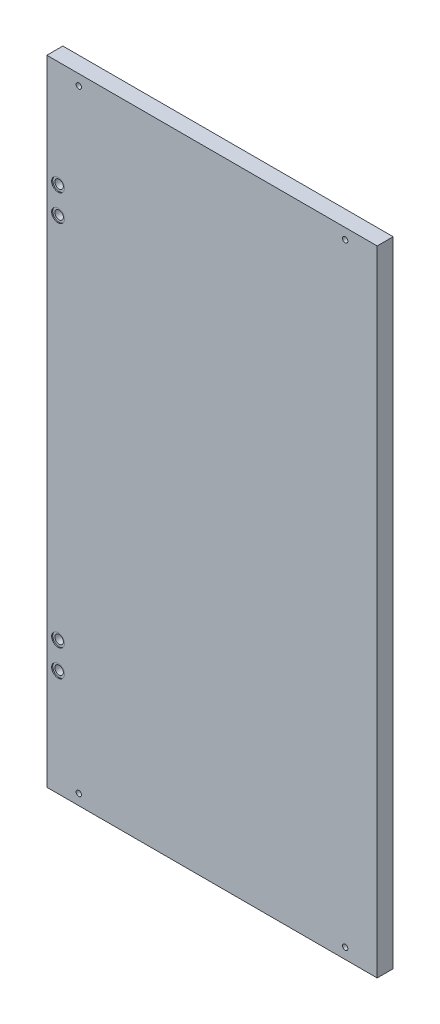
ISO-10303-21;
HEADER;
FILE_DESCRIPTION(('STEP AP214'),'2;1');
FILE_NAME('part.step','',(''),(''),'','','');
FILE_SCHEMA(('AUTOMOTIVE_DESIGN { 1 0 10303 214 1 1 1 1 }'));
ENDSEC;
DATA;
#1=APPLICATION_CONTEXT('core data for automotive mechanical design processes');
#2=APPLICATION_PROTOCOL_DEFINITION('international standard','automotive_design',2000,#1);
#3=PRODUCT_CONTEXT('',#1,'mechanical');
#4=PRODUCT('Part','Part','',(#3));
#5=PRODUCT_RELATED_PRODUCT_CATEGORY('part','',(#4));
#6=PRODUCT_DEFINITION_FORMATION('','',#4);
#7=PRODUCT_DEFINITION_CONTEXT('part definition',#1,'design');
#8=PRODUCT_DEFINITION('design','',#6,#7);
#9=PRODUCT_DEFINITION_SHAPE('','',#8);
#10=(LENGTH_UNIT() NAMED_UNIT(*) SI_UNIT(.MILLI.,.METRE.));
#11=(NAMED_UNIT(*) PLANE_ANGLE_UNIT() SI_UNIT($,.RADIAN.));
#12=(NAMED_UNIT(*) SI_UNIT($,.STERADIAN.) SOLID_ANGLE_UNIT());
#13=UNCERTAINTY_MEASURE_WITH_UNIT(LENGTH_MEASURE(1.E-05),#10,'distance_accuracy_value','');
#14=(GEOMETRIC_REPRESENTATION_CONTEXT(3) GLOBAL_UNCERTAINTY_ASSIGNED_CONTEXT((#13)) GLOBAL_UNIT_ASSIGNED_CONTEXT((#10,
#11,#12)) REPRESENTATION_CONTEXT('',''));
#15=CARTESIAN_POINT('',(0.,0.,0.));
#16=DIRECTION('',(0.,0.,1.));
#17=DIRECTION('',(1.,0.,0.));
#18=AXIS2_PLACEMENT_3D('',#15,#16,#17);
#19=CARTESIAN_POINT('',(-144.5,-172.5,0.));
#20=DIRECTION('',(0.,0.,1.));
#21=DIRECTION('',(1.,0.,0.));
#22=AXIS2_PLACEMENT_3D('',#19,#20,#21);
#23=CYLINDRICAL_SURFACE('',#22,3.99999999999999);
#24=CARTESIAN_POINT('',(-144.5,-172.5,0.));
#25=DIRECTION('',(0.,0.,-1.));
#26=DIRECTION('',(1.,0.,0.));
#27=AXIS2_PLACEMENT_3D('',#24,#25,#26);
#28=CIRCLE('',#27,3.99999999999999);
#29=CARTESIAN_POINT('',(-140.5,-172.5,0.));
#30=VERTEX_POINT('',#29);
#31=EDGE_CURVE('E160',#30,#30,#28,.T.);
#32=ORIENTED_EDGE('',*,*,#31,.T.);
#33=EDGE_LOOP('',(#32));
#34=FACE_BOUND('',#33,.T.);
#35=CARTESIAN_POINT('',(-144.5,-172.5,14.));
#36=DIRECTION('',(0.,0.,1.));
#37=DIRECTION('',(1.,0.,0.));
#38=AXIS2_PLACEMENT_3D('',#35,#36,#37);
#39=CIRCLE('',#38,3.99999999999999);
#40=CARTESIAN_POINT('',(-140.5,-172.5,14.));
#41=VERTEX_POINT('',#40);
#42=EDGE_CURVE('E41',#41,#41,#39,.T.);
#43=ORIENTED_EDGE('',*,*,#42,.T.);
#44=EDGE_LOOP('',(#43));
#45=FACE_BOUND('',#44,.T.);
#46=ADVANCED_FACE('F37',(#34,#45),#23,.F.);
#47=CARTESIAN_POINT('',(-144.5,-197.5,0.));
#48=DIRECTION('',(0.,0.,1.));
#49=DIRECTION('',(1.,0.,0.));
#50=AXIS2_PLACEMENT_3D('',#47,#48,#49);
#51=CYLINDRICAL_SURFACE('',#50,3.99999999999999);
#52=CARTESIAN_POINT('',(-144.5,-197.5,0.));
#53=DIRECTION('',(0.,0.,-1.));
#54=DIRECTION('',(1.,0.,0.));
#55=AXIS2_PLACEMENT_3D('',#52,#53,#54);
#56=CIRCLE('',#55,3.99999999999999);
#57=CARTESIAN_POINT('',(-140.5,-197.5,0.));
#58=VERTEX_POINT('',#57);
#59=EDGE_CURVE('E163',#58,#58,#56,.T.);
#60=ORIENTED_EDGE('',*,*,#59,.T.);
#61=EDGE_LOOP('',(#60));
#62=FACE_BOUND('',#61,.T.);
#63=CARTESIAN_POINT('',(-144.5,-197.5,14.));
#64=DIRECTION('',(0.,0.,1.));
#65=DIRECTION('',(1.,0.,0.));
#66=AXIS2_PLACEMENT_3D('',#63,#64,#65);
#67=CIRCLE('',#66,3.99999999999999);
#68=CARTESIAN_POINT('',(-140.5,-197.5,14.));
#69=VERTEX_POINT('',#68);
#70=EDGE_CURVE('E120',#69,#69,#67,.T.);
#71=ORIENTED_EDGE('',*,*,#70,.T.);
#72=EDGE_LOOP('',(#71));
#73=FACE_BOUND('',#72,.T.);
#74=ADVANCED_FACE('F193',(#62,#73),#51,.F.);
#75=CARTESIAN_POINT('',(-144.5,172.5,0.));
#76=DIRECTION('',(0.,0.,1.));
#77=DIRECTION('',(1.,0.,0.));
#78=AXIS2_PLACEMENT_3D('',#75,#76,#77);
#79=CYLINDRICAL_SURFACE('',#78,3.99999999999999);
#80=CARTESIAN_POINT('',(-144.5,172.5,0.));
#81=DIRECTION('',(0.,0.,1.));
#82=DIRECTION('',(1.,0.,0.));
#83=AXIS2_PLACEMENT_3D('',#80,#81,#82);
#84=CIRCLE('',#83,3.99999999999999);
#85=CARTESIAN_POINT('',(-140.5,172.5,0.));
#86=VERTEX_POINT('',#85);
#87=EDGE_CURVE('E178',#86,#86,#84,.T.);
#88=ORIENTED_EDGE('',*,*,#87,.F.);
#89=EDGE_LOOP('',(#88));
#90=FACE_BOUND('',#89,.T.);
#91=CARTESIAN_POINT('',(-144.5,172.5,14.));
#92=DIRECTION('',(0.,0.,1.));
#93=DIRECTION('',(1.,0.,0.));
#94=AXIS2_PLACEMENT_3D('',#91,#92,#93);
#95=CIRCLE('',#94,3.99999999999999);
#96=CARTESIAN_POINT('',(-140.5,172.5,14.));
#97=VERTEX_POINT('',#96);
#98=EDGE_CURVE('E116',#97,#97,#95,.F.);
#99=ORIENTED_EDGE('',*,*,#98,.F.);
#100=EDGE_LOOP('',(#99));
#101=FACE_BOUND('',#100,.T.);
#102=ADVANCED_FACE('F189',(#90,#101),#79,.F.);
#103=CARTESIAN_POINT('',(-144.5,197.5,0.));
#104=DIRECTION('',(0.,0.,1.));
#105=DIRECTION('',(1.,0.,0.));
#106=AXIS2_PLACEMENT_3D('',#103,#104,#105);
#107=CYLINDRICAL_SURFACE('',#106,3.99999999999999);
#108=CARTESIAN_POINT('',(-144.5,197.5,0.));
#109=DIRECTION('',(0.,0.,1.));
#110=DIRECTION('',(1.,0.,0.));
#111=AXIS2_PLACEMENT_3D('',#108,#109,#110);
#112=CIRCLE('',#111,3.99999999999999);
#113=CARTESIAN_POINT('',(-140.5,197.5,0.));
#114=VERTEX_POINT('',#113);
#115=EDGE_CURVE('E107',#114,#114,#112,.T.);
#116=ORIENTED_EDGE('',*,*,#115,.F.);
#117=EDGE_LOOP('',(#116));
#118=FACE_BOUND('',#117,.T.);
#119=CARTESIAN_POINT('',(-144.5,197.5,14.));
#120=DIRECTION('',(0.,0.,1.));
#121=DIRECTION('',(1.,0.,0.));
#122=AXIS2_PLACEMENT_3D('',#119,#120,#121);
#123=CIRCLE('',#122,3.99999999999999);
#124=CARTESIAN_POINT('',(-140.5,197.5,14.));
#125=VERTEX_POINT('',#124);
#126=EDGE_CURVE('E113',#125,#125,#123,.F.);
#127=ORIENTED_EDGE('',*,*,#126,.F.);
#128=EDGE_LOOP('',(#127));
#129=FACE_BOUND('',#128,.T.);
#130=ADVANCED_FACE('F192',(#118,#129),#107,.F.);
#131=CARTESIAN_POINT('',(155.,297.5,15.));
#132=DIRECTION('',(-1.,0.,0.));
#133=DIRECTION('',(0.,-1.,0.));
#134=AXIS2_PLACEMENT_3D('',#131,#132,#133);
#135=PLANE('',#134);
#136=DIRECTION('',(0.,1.,0.));
#137=VECTOR('',#136,1.);
#138=CARTESIAN_POINT('',(155.,297.5,0.));
#139=LINE('',#138,#137);
#140=CARTESIAN_POINT('',(155.,-297.5,0.));
#141=VERTEX_POINT('',#140);
#142=CARTESIAN_POINT('',(155.,297.5,0.));
#143=VERTEX_POINT('',#142);
#144=EDGE_CURVE('E104',#141,#143,#139,.T.);
#145=ORIENTED_EDGE('',*,*,#144,.T.);
#146=DIRECTION('',(0.,0.,-1.));
#147=VECTOR('',#146,1.);
#148=CARTESIAN_POINT('',(155.,297.5,15.));
#149=LINE('',#148,#147);
#150=CARTESIAN_POINT('',(155.,297.5,15.));
#151=VERTEX_POINT('',#150);
#152=EDGE_CURVE('E11',#151,#143,#149,.T.);
#153=ORIENTED_EDGE('',*,*,#152,.F.);
#154=DIRECTION('',(0.,1.,0.));
#155=VECTOR('',#154,1.);
#156=CARTESIAN_POINT('',(155.,297.5,15.));
#157=LINE('',#156,#155);
#158=CARTESIAN_POINT('',(155.,-297.5,15.));
#159=VERTEX_POINT('',#158);
#160=EDGE_CURVE('E91',#159,#151,#157,.T.);
#161=ORIENTED_EDGE('',*,*,#160,.F.);
#162=DIRECTION('',(0.,0.,-1.));
#163=VECTOR('',#162,1.);
#164=CARTESIAN_POINT('',(155.,-297.5,15.));
#165=LINE('',#164,#163);
#166=EDGE_CURVE('E100',#159,#141,#165,.T.);
#167=ORIENTED_EDGE('',*,*,#166,.T.);
#168=EDGE_LOOP('',(#145,#153,#161,#167));
#169=FACE_BOUND('',#168,.T.);
#170=ADVANCED_FACE('F39',(#169),#135,.F.);
#171=CARTESIAN_POINT('',(-155.,297.5,15.));
#172=DIRECTION('',(0.,-1.,0.));
#173=DIRECTION('',(0.,0.,-1.));
#174=AXIS2_PLACEMENT_3D('',#171,#172,#173);
#175=PLANE('',#174);
#176=DIRECTION('',(-1.,0.,0.));
#177=VECTOR('',#176,1.);
#178=CARTESIAN_POINT('',(-155.,297.5,0.));
#179=LINE('',#178,#177);
#180=CARTESIAN_POINT('',(-155.,297.5,0.));
#181=VERTEX_POINT('',#180);
#182=EDGE_CURVE('E95',#143,#181,#179,.T.);
#183=ORIENTED_EDGE('',*,*,#182,.T.);
#184=DIRECTION('',(0.,0.,-1.));
#185=VECTOR('',#184,1.);
#186=CARTESIAN_POINT('',(-155.,297.5,15.));
#187=LINE('',#186,#185);
#188=CARTESIAN_POINT('',(-155.,297.5,15.));
#189=VERTEX_POINT('',#188);
#190=EDGE_CURVE('E47',#189,#181,#187,.T.);
#191=ORIENTED_EDGE('',*,*,#190,.F.);
#192=DIRECTION('',(-1.,0.,0.));
#193=VECTOR('',#192,1.);
#194=CARTESIAN_POINT('',(-155.,297.5,15.));
#195=LINE('',#194,#193);
#196=EDGE_CURVE('E86',#151,#189,#195,.T.);
#197=ORIENTED_EDGE('',*,*,#196,.F.);
#198=ORIENTED_EDGE('',*,*,#152,.T.);
#199=EDGE_LOOP('',(#183,#191,#197,#198));
#200=FACE_BOUND('',#199,.T.);
#201=ADVANCED_FACE('F94',(#200),#175,.F.);
#202=CARTESIAN_POINT('',(-155.,297.5,15.));
#203=DIRECTION('',(1.,0.,0.));
#204=DIRECTION('',(0.,1.,0.));
#205=AXIS2_PLACEMENT_3D('',#202,#203,#204);
#206=PLANE('',#205);
#207=DIRECTION('',(0.,-1.,0.));
#208=VECTOR('',#207,1.);
#209=CARTESIAN_POINT('',(-155.,297.5,0.));
#210=LINE('',#209,#208);
#211=CARTESIAN_POINT('',(-155.,-297.5,0.));
#212=VERTEX_POINT('',#211);
#213=EDGE_CURVE('E73',#181,#212,#210,.T.);
#214=ORIENTED_EDGE('',*,*,#213,.T.);
#215=DIRECTION('',(0.,0.,-1.));
#216=VECTOR('',#215,1.);
#217=CARTESIAN_POINT('',(-155.,-297.5,15.));
#218=LINE('',#217,#216);
#219=CARTESIAN_POINT('',(-155.,-297.5,15.));
#220=VERTEX_POINT('',#219);
#221=EDGE_CURVE('E96',#220,#212,#218,.T.);
#222=ORIENTED_EDGE('',*,*,#221,.F.);
#223=DIRECTION('',(0.,-1.,0.));
#224=VECTOR('',#223,1.);
#225=CARTESIAN_POINT('',(-155.,297.5,15.));
#226=LINE('',#225,#224);
#227=EDGE_CURVE('E89',#189,#220,#226,.T.);
#228=ORIENTED_EDGE('',*,*,#227,.F.);
#229=ORIENTED_EDGE('',*,*,#190,.T.);
#230=EDGE_LOOP('',(#214,#222,#228,#229));
#231=FACE_BOUND('',#230,.T.);
#232=ADVANCED_FACE('F98',(#231),#206,.F.);
#233=CARTESIAN_POINT('',(-155.,-297.5,15.));
#234=DIRECTION('',(0.,1.,0.));
#235=DIRECTION('',(0.,0.,1.));
#236=AXIS2_PLACEMENT_3D('',#233,#234,#235);
#237=PLANE('',#236);
#238=DIRECTION('',(1.,0.,0.));
#239=VECTOR('',#238,1.);
#240=CARTESIAN_POINT('',(-155.,-297.5,0.));
#241=LINE('',#240,#239);
#242=EDGE_CURVE('E79',#212,#141,#241,.T.);
#243=ORIENTED_EDGE('',*,*,#242,.T.);
#244=ORIENTED_EDGE('',*,*,#166,.F.);
#245=DIRECTION('',(1.,0.,0.));
#246=VECTOR('',#245,1.);
#247=CARTESIAN_POINT('',(-155.,-297.5,15.));
#248=LINE('',#247,#246);
#249=EDGE_CURVE('E56',#220,#159,#248,.T.);
#250=ORIENTED_EDGE('',*,*,#249,.F.);
#251=ORIENTED_EDGE('',*,*,#221,.T.);
#252=EDGE_LOOP('',(#243,#244,#250,#251));
#253=FACE_BOUND('',#252,.T.);
#254=ADVANCED_FACE('F239',(#253),#237,.F.);
#255=CARTESIAN_POINT('',(0.,0.,15.));
#256=DIRECTION('',(0.,0.,1.));
#257=DIRECTION('',(1.,0.,0.));
#258=AXIS2_PLACEMENT_3D('',#255,#256,#257);
#259=PLANE('',#258);
#260=CARTESIAN_POINT('',(-144.5,-197.5,15.));
#261=DIRECTION('',(0.,0.,-1.));
#262=DIRECTION('',(1.,0.,0.));
#263=AXIS2_PLACEMENT_3D('',#260,#261,#262);
#264=CIRCLE('',#263,6.00000000000002);
#265=CARTESIAN_POINT('',(-138.5,-197.5,15.));
#266=VERTEX_POINT('',#265);
#267=EDGE_CURVE('E128',#266,#266,#264,.T.);
#268=ORIENTED_EDGE('',*,*,#267,.T.);
#269=EDGE_LOOP('',(#268));
#270=FACE_BOUND('',#269,.T.);
#271=CARTESIAN_POINT('',(-144.5,-172.5,15.));
#272=DIRECTION('',(0.,0.,-1.));
#273=DIRECTION('',(1.,0.,0.));
#274=AXIS2_PLACEMENT_3D('',#271,#272,#273);
#275=CIRCLE('',#274,6.00000000000002);
#276=CARTESIAN_POINT('',(-138.5,-172.5,15.));
#277=VERTEX_POINT('',#276);
#278=EDGE_CURVE('E138',#277,#277,#275,.T.);
#279=ORIENTED_EDGE('',*,*,#278,.T.);
#280=EDGE_LOOP('',(#279));
#281=FACE_BOUND('',#280,.T.);
#282=CARTESIAN_POINT('',(-144.5,197.5,15.));
#283=DIRECTION('',(0.,0.,1.));
#284=DIRECTION('',(1.,0.,0.));
#285=AXIS2_PLACEMENT_3D('',#282,#283,#284);
#286=CIRCLE('',#285,6.00000000000002);
#287=CARTESIAN_POINT('',(-138.5,197.5,15.));
#288=VERTEX_POINT('',#287);
#289=EDGE_CURVE('E143',#288,#288,#286,.T.);
#290=ORIENTED_EDGE('',*,*,#289,.F.);
#291=EDGE_LOOP('',(#290));
#292=FACE_BOUND('',#291,.T.);
#293=CARTESIAN_POINT('',(-144.5,172.5,15.));
#294=DIRECTION('',(0.,0.,1.));
#295=DIRECTION('',(1.,0.,0.));
#296=AXIS2_PLACEMENT_3D('',#293,#294,#295);
#297=CIRCLE('',#296,6.00000000000002);
#298=CARTESIAN_POINT('',(-138.5,172.5,15.));
#299=VERTEX_POINT('',#298);
#300=EDGE_CURVE('E146',#299,#299,#297,.T.);
#301=ORIENTED_EDGE('',*,*,#300,.F.);
#302=EDGE_LOOP('',(#301));
#303=FACE_BOUND('',#302,.T.);
#304=CARTESIAN_POINT('',(125.,287.5,15.));
#305=DIRECTION('',(0.,0.,-1.));
#306=DIRECTION('',(-1.,0.,0.));
#307=AXIS2_PLACEMENT_3D('',#304,#305,#306);
#308=CIRCLE('',#307,2.5);
#309=CARTESIAN_POINT('',(122.5,287.5,15.));
#310=VERTEX_POINT('',#309);
#311=EDGE_CURVE('E119',#310,#310,#308,.T.);
#312=ORIENTED_EDGE('',*,*,#311,.T.);
#313=EDGE_LOOP('',(#312));
#314=FACE_BOUND('',#313,.T.);
#315=CARTESIAN_POINT('',(125.,-287.5,15.));
#316=DIRECTION('',(0.,0.,1.));
#317=DIRECTION('',(-1.,0.,0.));
#318=AXIS2_PLACEMENT_3D('',#315,#316,#317);
#319=CIRCLE('',#318,2.5);
#320=CARTESIAN_POINT('',(122.5,-287.5,15.));
#321=VERTEX_POINT('',#320);
#322=EDGE_CURVE('E154',#321,#321,#319,.T.);
#323=ORIENTED_EDGE('',*,*,#322,.F.);
#324=EDGE_LOOP('',(#323));
#325=FACE_BOUND('',#324,.T.);
#326=CARTESIAN_POINT('',(-125.,-287.5,15.));
#327=DIRECTION('',(0.,0.,-1.));
#328=DIRECTION('',(1.,0.,0.));
#329=AXIS2_PLACEMENT_3D('',#326,#327,#328);
#330=CIRCLE('',#329,2.5);
#331=CARTESIAN_POINT('',(-122.5,-287.5,15.));
#332=VERTEX_POINT('',#331);
#333=EDGE_CURVE('E166',#332,#332,#330,.T.);
#334=ORIENTED_EDGE('',*,*,#333,.T.);
#335=EDGE_LOOP('',(#334));
#336=FACE_BOUND('',#335,.T.);
#337=CARTESIAN_POINT('',(-125.,287.5,15.));
#338=DIRECTION('',(0.,0.,1.));
#339=DIRECTION('',(1.,0.,0.));
#340=AXIS2_PLACEMENT_3D('',#337,#338,#339);
#341=CIRCLE('',#340,2.5);
#342=CARTESIAN_POINT('',(-122.5,287.5,15.));
#343=VERTEX_POINT('',#342);
#344=EDGE_CURVE('E172',#343,#343,#341,.T.);
#345=ORIENTED_EDGE('',*,*,#344,.F.);
#346=EDGE_LOOP('',(#345));
#347=FACE_BOUND('',#346,.T.);
#348=ORIENTED_EDGE('',*,*,#160,.T.);
#349=ORIENTED_EDGE('',*,*,#196,.T.);
#350=ORIENTED_EDGE('',*,*,#227,.T.);
#351=ORIENTED_EDGE('',*,*,#249,.T.);
#352=EDGE_LOOP('',(#348,#349,#350,#351));
#353=FACE_BOUND('',#352,.T.);
#354=ADVANCED_FACE('F87',(#270,#281,#292,#303,#314,#325,#336,#347,#353),#259,.T.);
#355=CARTESIAN_POINT('',(0.,0.,0.));
#356=DIRECTION('',(0.,0.,1.));
#357=DIRECTION('',(1.,0.,0.));
#358=AXIS2_PLACEMENT_3D('',#355,#356,#357);
#359=PLANE('',#358);
#360=CARTESIAN_POINT('',(125.,287.5,0.));
#361=DIRECTION('',(0.,0.,-1.));
#362=DIRECTION('',(-1.,0.,0.));
#363=AXIS2_PLACEMENT_3D('',#360,#361,#362);
#364=CIRCLE('',#363,2.5);
#365=CARTESIAN_POINT('',(122.5,287.5,0.));
#366=VERTEX_POINT('',#365);
#367=EDGE_CURVE('E151',#366,#366,#364,.T.);
#368=ORIENTED_EDGE('',*,*,#367,.F.);
#369=EDGE_LOOP('',(#368));
#370=FACE_BOUND('',#369,.T.);
#371=CARTESIAN_POINT('',(125.,-287.5,0.));
#372=DIRECTION('',(0.,0.,1.));
#373=DIRECTION('',(-1.,0.,0.));
#374=AXIS2_PLACEMENT_3D('',#371,#372,#373);
#375=CIRCLE('',#374,2.5);
#376=CARTESIAN_POINT('',(122.5,-287.5,0.));
#377=VERTEX_POINT('',#376);
#378=EDGE_CURVE('E157',#377,#377,#375,.T.);
#379=ORIENTED_EDGE('',*,*,#378,.T.);
#380=EDGE_LOOP('',(#379));
#381=FACE_BOUND('',#380,.T.);
#382=ORIENTED_EDGE('',*,*,#59,.F.);
#383=EDGE_LOOP('',(#382));
#384=FACE_BOUND('',#383,.T.);
#385=ORIENTED_EDGE('',*,*,#31,.F.);
#386=EDGE_LOOP('',(#385));
#387=FACE_BOUND('',#386,.T.);
#388=CARTESIAN_POINT('',(-125.,-287.5,0.));
#389=DIRECTION('',(0.,0.,-1.));
#390=DIRECTION('',(1.,0.,0.));
#391=AXIS2_PLACEMENT_3D('',#388,#389,#390);
#392=CIRCLE('',#391,2.5);
#393=CARTESIAN_POINT('',(-122.5,-287.5,0.));
#394=VERTEX_POINT('',#393);
#395=EDGE_CURVE('E169',#394,#394,#392,.T.);
#396=ORIENTED_EDGE('',*,*,#395,.F.);
#397=EDGE_LOOP('',(#396));
#398=FACE_BOUND('',#397,.T.);
#399=CARTESIAN_POINT('',(-125.,287.5,0.));
#400=DIRECTION('',(0.,0.,1.));
#401=DIRECTION('',(1.,0.,0.));
#402=AXIS2_PLACEMENT_3D('',#399,#400,#401);
#403=CIRCLE('',#402,2.5);
#404=CARTESIAN_POINT('',(-122.5,287.5,0.));
#405=VERTEX_POINT('',#404);
#406=EDGE_CURVE('E175',#405,#405,#403,.T.);
#407=ORIENTED_EDGE('',*,*,#406,.T.);
#408=EDGE_LOOP('',(#407));
#409=FACE_BOUND('',#408,.T.);
#410=ORIENTED_EDGE('',*,*,#115,.T.);
#411=EDGE_LOOP('',(#410));
#412=FACE_BOUND('',#411,.T.);
#413=ORIENTED_EDGE('',*,*,#87,.T.);
#414=EDGE_LOOP('',(#413));
#415=FACE_BOUND('',#414,.T.);
#416=ORIENTED_EDGE('',*,*,#144,.F.);
#417=ORIENTED_EDGE('',*,*,#242,.F.);
#418=ORIENTED_EDGE('',*,*,#213,.F.);
#419=ORIENTED_EDGE('',*,*,#182,.F.);
#420=EDGE_LOOP('',(#416,#417,#418,#419));
#421=FACE_BOUND('',#420,.T.);
#422=ADVANCED_FACE('F186',(#370,#381,#384,#387,#398,#409,#412,#415,#421),#359,.F.);
#423=CARTESIAN_POINT('',(-125.,287.5,0.));
#424=DIRECTION('',(0.,0.,1.));
#425=DIRECTION('',(1.,0.,0.));
#426=AXIS2_PLACEMENT_3D('',#423,#424,#425);
#427=CYLINDRICAL_SURFACE('',#426,2.5);
#428=ORIENTED_EDGE('',*,*,#406,.F.);
#429=EDGE_LOOP('',(#428));
#430=FACE_BOUND('',#429,.T.);
#431=ORIENTED_EDGE('',*,*,#344,.T.);
#432=EDGE_LOOP('',(#431));
#433=FACE_BOUND('',#432,.T.);
#434=ADVANCED_FACE('F229',(#430,#433),#427,.F.);
#435=CARTESIAN_POINT('',(-125.,-287.5,0.));
#436=DIRECTION('',(0.,0.,1.));
#437=DIRECTION('',(1.,0.,0.));
#438=AXIS2_PLACEMENT_3D('',#435,#436,#437);
#439=CYLINDRICAL_SURFACE('',#438,2.5);
#440=ORIENTED_EDGE('',*,*,#395,.T.);
#441=EDGE_LOOP('',(#440));
#442=FACE_BOUND('',#441,.T.);
#443=ORIENTED_EDGE('',*,*,#333,.F.);
#444=EDGE_LOOP('',(#443));
#445=FACE_BOUND('',#444,.T.);
#446=ADVANCED_FACE('F225',(#442,#445),#439,.F.);
#447=CARTESIAN_POINT('',(125.,-287.5,0.));
#448=DIRECTION('',(0.,0.,1.));
#449=DIRECTION('',(1.,0.,0.));
#450=AXIS2_PLACEMENT_3D('',#447,#448,#449);
#451=CYLINDRICAL_SURFACE('',#450,2.5);
#452=ORIENTED_EDGE('',*,*,#378,.F.);
#453=EDGE_LOOP('',(#452));
#454=FACE_BOUND('',#453,.T.);
#455=ORIENTED_EDGE('',*,*,#322,.T.);
#456=EDGE_LOOP('',(#455));
#457=FACE_BOUND('',#456,.T.);
#458=ADVANCED_FACE('F228',(#454,#457),#451,.F.);
#459=CARTESIAN_POINT('',(125.,287.5,0.));
#460=DIRECTION('',(0.,0.,1.));
#461=DIRECTION('',(1.,0.,0.));
#462=AXIS2_PLACEMENT_3D('',#459,#460,#461);
#463=CYLINDRICAL_SURFACE('',#462,2.5);
#464=ORIENTED_EDGE('',*,*,#367,.T.);
#465=EDGE_LOOP('',(#464));
#466=FACE_BOUND('',#465,.T.);
#467=ORIENTED_EDGE('',*,*,#311,.F.);
#468=EDGE_LOOP('',(#467));
#469=FACE_BOUND('',#468,.T.);
#470=ADVANCED_FACE('F362',(#466,#469),#463,.F.);
#471=CARTESIAN_POINT('',(-144.5,197.5,14.));
#472=DIRECTION('',(0.,0.,1.));
#473=DIRECTION('',(1.,0.,0.));
#474=AXIS2_PLACEMENT_3D('',#471,#472,#473);
#475=PLANE('',#474);
#476=CARTESIAN_POINT('',(-144.5,197.5,14.));
#477=DIRECTION('',(0.,0.,1.));
#478=DIRECTION('',(1.,0.,0.));
#479=AXIS2_PLACEMENT_3D('',#476,#477,#478);
#480=CIRCLE('',#479,6.00000000000002);
#481=CARTESIAN_POINT('',(-138.5,197.5,14.));
#482=VERTEX_POINT('',#481);
#483=EDGE_CURVE('E117',#482,#482,#480,.T.);
#484=ORIENTED_EDGE('',*,*,#483,.T.);
#485=EDGE_LOOP('',(#484));
#486=FACE_BOUND('',#485,.T.);
#487=ORIENTED_EDGE('',*,*,#126,.T.);
#488=EDGE_LOOP('',(#487));
#489=FACE_BOUND('',#488,.T.);
#490=ADVANCED_FACE('F210',(#486,#489),#475,.T.);
#491=CARTESIAN_POINT('',(-144.5,197.5,14.));
#492=DIRECTION('',(0.,0.,1.));
#493=DIRECTION('',(1.,0.,0.));
#494=AXIS2_PLACEMENT_3D('',#491,#492,#493);
#495=CYLINDRICAL_SURFACE('',#494,6.00000000000002);
#496=ORIENTED_EDGE('',*,*,#483,.F.);
#497=EDGE_LOOP('',(#496));
#498=FACE_BOUND('',#497,.T.);
#499=ORIENTED_EDGE('',*,*,#289,.T.);
#500=EDGE_LOOP('',(#499));
#501=FACE_BOUND('',#500,.T.);
#502=ADVANCED_FACE('F200',(#498,#501),#495,.F.);
#503=CARTESIAN_POINT('',(-144.5,172.5,14.));
#504=DIRECTION('',(0.,0.,1.));
#505=DIRECTION('',(1.,0.,0.));
#506=AXIS2_PLACEMENT_3D('',#503,#504,#505);
#507=PLANE('',#506);
#508=CARTESIAN_POINT('',(-144.5,172.5,14.));
#509=DIRECTION('',(0.,0.,1.));
#510=DIRECTION('',(1.,0.,0.));
#511=AXIS2_PLACEMENT_3D('',#508,#509,#510);
#512=CIRCLE('',#511,6.00000000000002);
#513=CARTESIAN_POINT('',(-138.5,172.5,14.));
#514=VERTEX_POINT('',#513);
#515=EDGE_CURVE('E126',#514,#514,#512,.T.);
#516=ORIENTED_EDGE('',*,*,#515,.T.);
#517=EDGE_LOOP('',(#516));
#518=FACE_BOUND('',#517,.T.);
#519=ORIENTED_EDGE('',*,*,#98,.T.);
#520=EDGE_LOOP('',(#519));
#521=FACE_BOUND('',#520,.T.);
#522=ADVANCED_FACE('F197',(#518,#521),#507,.T.);
#523=CARTESIAN_POINT('',(-144.5,172.5,14.));
#524=DIRECTION('',(0.,0.,1.));
#525=DIRECTION('',(1.,0.,0.));
#526=AXIS2_PLACEMENT_3D('',#523,#524,#525);
#527=CYLINDRICAL_SURFACE('',#526,6.00000000000002);
#528=ORIENTED_EDGE('',*,*,#515,.F.);
#529=EDGE_LOOP('',(#528));
#530=FACE_BOUND('',#529,.T.);
#531=ORIENTED_EDGE('',*,*,#300,.T.);
#532=EDGE_LOOP('',(#531));
#533=FACE_BOUND('',#532,.T.);
#534=ADVANCED_FACE('F199',(#530,#533),#527,.F.);
#535=CARTESIAN_POINT('',(-144.5,-197.5,14.));
#536=DIRECTION('',(0.,0.,1.));
#537=DIRECTION('',(1.,0.,0.));
#538=AXIS2_PLACEMENT_3D('',#535,#536,#537);
#539=CYLINDRICAL_SURFACE('',#538,6.00000000000002);
#540=CARTESIAN_POINT('',(-144.5,-197.5,14.));
#541=DIRECTION('',(0.,0.,-1.));
#542=DIRECTION('',(1.,0.,0.));
#543=AXIS2_PLACEMENT_3D('',#540,#541,#542);
#544=CIRCLE('',#543,6.00000000000002);
#545=CARTESIAN_POINT('',(-138.5,-197.5,14.));
#546=VERTEX_POINT('',#545);
#547=EDGE_CURVE('E122',#546,#546,#544,.T.);
#548=ORIENTED_EDGE('',*,*,#547,.T.);
#549=EDGE_LOOP('',(#548));
#550=FACE_BOUND('',#549,.T.);
#551=ORIENTED_EDGE('',*,*,#267,.F.);
#552=EDGE_LOOP('',(#551));
#553=FACE_BOUND('',#552,.T.);
#554=ADVANCED_FACE('F207',(#550,#553),#539,.F.);
#555=CARTESIAN_POINT('',(-144.5,-197.5,14.));
#556=DIRECTION('',(0.,0.,1.));
#557=DIRECTION('',(1.,0.,0.));
#558=AXIS2_PLACEMENT_3D('',#555,#556,#557);
#559=PLANE('',#558);
#560=ORIENTED_EDGE('',*,*,#70,.F.);
#561=EDGE_LOOP('',(#560));
#562=FACE_BOUND('',#561,.T.);
#563=ORIENTED_EDGE('',*,*,#547,.F.);
#564=EDGE_LOOP('',(#563));
#565=FACE_BOUND('',#564,.T.);
#566=ADVANCED_FACE('F291',(#562,#565),#559,.T.);
#567=CARTESIAN_POINT('',(-144.5,-172.5,14.));
#568=DIRECTION('',(0.,0.,1.));
#569=DIRECTION('',(1.,0.,0.));
#570=AXIS2_PLACEMENT_3D('',#567,#568,#569);
#571=CYLINDRICAL_SURFACE('',#570,6.00000000000002);
#572=CARTESIAN_POINT('',(-144.5,-172.5,14.));
#573=DIRECTION('',(0.,0.,-1.));
#574=DIRECTION('',(1.,0.,0.));
#575=AXIS2_PLACEMENT_3D('',#572,#573,#574);
#576=CIRCLE('',#575,6.00000000000002);
#577=CARTESIAN_POINT('',(-138.5,-172.5,14.));
#578=VERTEX_POINT('',#577);
#579=EDGE_CURVE('E133',#578,#578,#576,.T.);
#580=ORIENTED_EDGE('',*,*,#579,.T.);
#581=EDGE_LOOP('',(#580));
#582=FACE_BOUND('',#581,.T.);
#583=ORIENTED_EDGE('',*,*,#278,.F.);
#584=EDGE_LOOP('',(#583));
#585=FACE_BOUND('',#584,.T.);
#586=ADVANCED_FACE('F302',(#582,#585),#571,.F.);
#587=CARTESIAN_POINT('',(-144.5,-172.5,14.));
#588=DIRECTION('',(0.,0.,1.));
#589=DIRECTION('',(1.,0.,0.));
#590=AXIS2_PLACEMENT_3D('',#587,#588,#589);
#591=PLANE('',#590);
#592=ORIENTED_EDGE('',*,*,#42,.F.);
#593=EDGE_LOOP('',(#592));
#594=FACE_BOUND('',#593,.T.);
#595=ORIENTED_EDGE('',*,*,#579,.F.);
#596=EDGE_LOOP('',(#595));
#597=FACE_BOUND('',#596,.T.);
#598=ADVANCED_FACE('F313',(#594,#597),#591,.T.);
#599=CLOSED_SHELL('',(#46,#74,#102,#130,#170,#201,#232,#254,#354,#422,#434,#446,#458,#470,#490,
#502,#522,#534,#554,#566,#586,#598));
#600=MANIFOLD_SOLID_BREP('B2',#599);
#601=ADVANCED_BREP_SHAPE_REPRESENTATION('',(#18,#600),#14);
#602=SHAPE_DEFINITION_REPRESENTATION(#9,#601);
ENDSEC;
END-ISO-10303-21;
